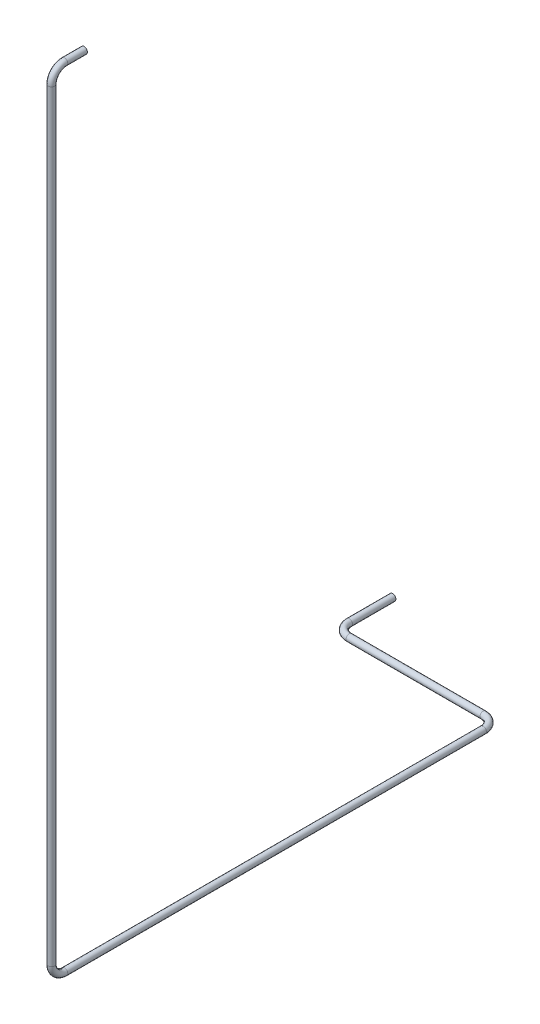
ISO-10303-21;
HEADER;
FILE_DESCRIPTION(('STEP AP214'),'2;1');
FILE_NAME('part.step','',(''),(''),'','','');
FILE_SCHEMA(('AUTOMOTIVE_DESIGN { 1 0 10303 214 1 1 1 1 }'));
ENDSEC;
DATA;
#1=APPLICATION_CONTEXT('core data for automotive mechanical design processes');
#2=APPLICATION_PROTOCOL_DEFINITION('international standard','automotive_design',2000,#1);
#3=PRODUCT_CONTEXT('',#1,'mechanical');
#4=PRODUCT('Part','Part','',(#3));
#5=PRODUCT_RELATED_PRODUCT_CATEGORY('part','',(#4));
#6=PRODUCT_DEFINITION_FORMATION('','',#4);
#7=PRODUCT_DEFINITION_CONTEXT('part definition',#1,'design');
#8=PRODUCT_DEFINITION('design','',#6,#7);
#9=PRODUCT_DEFINITION_SHAPE('','',#8);
#10=(LENGTH_UNIT() NAMED_UNIT(*) SI_UNIT(.MILLI.,.METRE.));
#11=(NAMED_UNIT(*) PLANE_ANGLE_UNIT() SI_UNIT($,.RADIAN.));
#12=(NAMED_UNIT(*) SI_UNIT($,.STERADIAN.) SOLID_ANGLE_UNIT());
#13=UNCERTAINTY_MEASURE_WITH_UNIT(LENGTH_MEASURE(1.E-05),#10,'distance_accuracy_value','');
#14=(GEOMETRIC_REPRESENTATION_CONTEXT(3) GLOBAL_UNCERTAINTY_ASSIGNED_CONTEXT((#13)) GLOBAL_UNIT_ASSIGNED_CONTEXT((#10,
#11,#12)) REPRESENTATION_CONTEXT('',''));
#15=CARTESIAN_POINT('',(0.,0.,0.));
#16=DIRECTION('',(0.,0.,1.));
#17=DIRECTION('',(1.,0.,0.));
#18=AXIS2_PLACEMENT_3D('',#15,#16,#17);
#19=CARTESIAN_POINT('',(-33126.1176832916,-14247.0136339342,43140.4701960568));
#20=DIRECTION('',(0.,0.,-1.));
#21=DIRECTION('',(1.,0.,0.));
#22=AXIS2_PLACEMENT_3D('',#19,#20,#21);
#23=PLANE('',#22);
#24=CARTESIAN_POINT('',(-33126.1176832916,-14247.0136339342,43140.4701960568));
#25=DIRECTION('',(0.,0.,-1.));
#26=DIRECTION('',(-1.,0.,0.));
#27=AXIS2_PLACEMENT_3D('',#24,#25,#26);
#28=CIRCLE('',#27,14.0000000000006);
#29=CARTESIAN_POINT('',(-33140.1176832916,-14247.0136339342,43140.4701960568));
#30=VERTEX_POINT('',#29);
#31=EDGE_CURVE('E88',#30,#30,#28,.T.);
#32=ORIENTED_EDGE('',*,*,#31,.F.);
#33=EDGE_LOOP('',(#32));
#34=FACE_BOUND('',#33,.T.);
#35=CARTESIAN_POINT('',(-33126.1176832916,-14247.0136339342,43140.4701960568));
#36=DIRECTION('',(0.,0.,-1.));
#37=DIRECTION('',(1.,0.,0.));
#38=AXIS2_PLACEMENT_3D('',#35,#36,#37);
#39=CIRCLE('',#38,15.0000000000006);
#40=CARTESIAN_POINT('',(-33111.1176832916,-14247.0136339342,43140.4701960568));
#41=VERTEX_POINT('',#40);
#42=EDGE_CURVE('E81',#41,#41,#39,.T.);
#43=ORIENTED_EDGE('',*,*,#42,.T.);
#44=EDGE_LOOP('',(#43));
#45=FACE_BOUND('',#44,.T.);
#46=ADVANCED_FACE('F47',(#34,#45),#23,.T.);
#47=CARTESIAN_POINT('',(-33860.3786769094,-17862.3317724565,40991.2422902798));
#48=DIRECTION('',(0.,0.,1.));
#49=DIRECTION('',(1.,0.,0.));
#50=AXIS2_PLACEMENT_3D('',#47,#48,#49);
#51=PLANE('',#50);
#52=CARTESIAN_POINT('',(-33860.3786769094,-17862.3317724565,40991.2422902798));
#53=DIRECTION('',(0.,0.,1.));
#54=DIRECTION('',(1.,0.,0.));
#55=AXIS2_PLACEMENT_3D('',#52,#53,#54);
#56=CIRCLE('',#55,14.0000000000006);
#57=CARTESIAN_POINT('',(-33846.3786769094,-17862.3317724565,40991.2422902798));
#58=VERTEX_POINT('',#57);
#59=EDGE_CURVE('E84',#58,#58,#56,.T.);
#60=ORIENTED_EDGE('',*,*,#59,.T.);
#61=EDGE_LOOP('',(#60));
#62=FACE_BOUND('',#61,.T.);
#63=CARTESIAN_POINT('',(-33860.3786769094,-17862.3317724565,40991.2422902798));
#64=DIRECTION('',(0.,0.,1.));
#65=DIRECTION('',(1.,0.,0.));
#66=AXIS2_PLACEMENT_3D('',#63,#64,#65);
#67=CIRCLE('',#66,15.0000000000006);
#68=CARTESIAN_POINT('',(-33845.3786769094,-17862.3317724565,40991.2422902798));
#69=VERTEX_POINT('',#68);
#70=EDGE_CURVE('E11',#69,#69,#67,.T.);
#71=ORIENTED_EDGE('',*,*,#70,.F.);
#72=EDGE_LOOP('',(#71));
#73=FACE_BOUND('',#72,.T.);
#74=ADVANCED_FACE('F126',(#62,#73),#51,.F.);
#75=CARTESIAN_POINT('',(-33126.1176832916,-14247.0136339342,43140.4701960568));
#76=DIRECTION('',(0.,0.,1.));
#77=DIRECTION('',(1.,0.,0.));
#78=AXIS2_PLACEMENT_3D('',#75,#76,#77);
#79=CYLINDRICAL_SURFACE('',#78,15.0000000000006);
#80=CARTESIAN_POINT('',(-33126.1176832916,-14247.0136339342,43230.4701960568));
#81=DIRECTION('',(0.,0.,-1.));
#82=DIRECTION('',(1.,0.,0.));
#83=AXIS2_PLACEMENT_3D('',#80,#81,#82);
#84=CIRCLE('',#83,15.0000000000006);
#85=CARTESIAN_POINT('',(-33126.1176832916,-14232.0136339342,43230.4701960568));
#86=VERTEX_POINT('',#85);
#87=EDGE_CURVE('E78',#86,#86,#84,.T.);
#88=ORIENTED_EDGE('',*,*,#87,.T.);
#89=EDGE_LOOP('',(#88));
#90=FACE_BOUND('',#89,.T.);
#91=ORIENTED_EDGE('',*,*,#42,.F.);
#92=EDGE_LOOP('',(#91));
#93=FACE_BOUND('',#92,.T.);
#94=ADVANCED_FACE('F130',(#90,#93),#79,.T.);
#95=CARTESIAN_POINT('',(-33126.1176832916,-14307.0136339342,43230.4701960568));
#96=DIRECTION('',(1.,0.,0.));
#97=DIRECTION('',(0.,0.,-1.));
#98=AXIS2_PLACEMENT_3D('',#95,#96,#97);
#99=TOROIDAL_SURFACE('',#98,60.0000000000023,15.0000000000006);
#100=CARTESIAN_POINT('',(-33126.1176832916,-14307.0136339342,43290.4701960568));
#101=DIRECTION('',(0.,1.,0.));
#102=DIRECTION('',(1.,0.,0.));
#103=AXIS2_PLACEMENT_3D('',#100,#101,#102);
#104=CIRCLE('',#103,15.0000000000006);
#105=CARTESIAN_POINT('',(-33126.1176832916,-14307.0136339342,43305.4701960568));
#106=VERTEX_POINT('',#105);
#107=EDGE_CURVE('E75',#106,#106,#104,.T.);
#108=CARTESIAN_POINT('',(-33126.1176832916,-14307.0136339342,43230.4701960568));
#109=DIRECTION('',(1.,0.,0.));
#110=DIRECTION('',(0.,0.,-1.));
#111=AXIS2_PLACEMENT_3D('',#108,#109,#110);
#112=CIRCLE('',#111,75.0000000000028);
#113=EDGE_CURVE('',#86,#106,#112,.T.);
#114=ORIENTED_EDGE('',*,*,#87,.F.);
#115=ORIENTED_EDGE('',*,*,#107,.T.);
#116=ORIENTED_EDGE('',*,*,#113,.T.);
#117=ORIENTED_EDGE('',*,*,#113,.F.);
#118=EDGE_LOOP('',(#114,#116,#115,#117));
#119=FACE_BOUND('',#118,.T.);
#120=ADVANCED_FACE('F132',(#119),#99,.T.);
#121=CARTESIAN_POINT('',(-33126.1176832916,-14307.0136339342,43290.4701960568));
#122=DIRECTION('',(0.,-1.,0.));
#123=DIRECTION('',(0.,0.,-1.));
#124=AXIS2_PLACEMENT_3D('',#121,#122,#123);
#125=CYLINDRICAL_SURFACE('',#124,15.0000000000006);
#126=CARTESIAN_POINT('',(-33126.1176832916,-17802.3317724565,43290.4701960568));
#127=DIRECTION('',(0.,1.,0.));
#128=DIRECTION('',(1.,0.,0.));
#129=AXIS2_PLACEMENT_3D('',#126,#127,#128);
#130=CIRCLE('',#129,15.0000000000006);
#131=CARTESIAN_POINT('',(-33126.1176832916,-17802.3317724565,43305.4701960568));
#132=VERTEX_POINT('',#131);
#133=EDGE_CURVE('E72',#132,#132,#130,.T.);
#134=ORIENTED_EDGE('',*,*,#133,.T.);
#135=EDGE_LOOP('',(#134));
#136=FACE_BOUND('',#135,.T.);
#137=ORIENTED_EDGE('',*,*,#107,.F.);
#138=EDGE_LOOP('',(#137));
#139=FACE_BOUND('',#138,.T.);
#140=ADVANCED_FACE('F139',(#136,#139),#125,.T.);
#141=CARTESIAN_POINT('',(-33126.1176832916,-17802.3317724565,43230.4701960568));
#142=DIRECTION('',(1.,0.,0.));
#143=DIRECTION('',(0.,0.,-1.));
#144=AXIS2_PLACEMENT_3D('',#141,#142,#143);
#145=TOROIDAL_SURFACE('',#144,60.0000000000023,15.0000000000006);
#146=CARTESIAN_POINT('',(-33126.1176832916,-17862.3317724614,43230.4701960547));
#147=DIRECTION('',(0.,0.,1.));
#148=DIRECTION('',(1.,0.,0.));
#149=AXIS2_PLACEMENT_3D('',#146,#147,#148);
#150=CIRCLE('',#149,15.0000000000006);
#151=CARTESIAN_POINT('',(-33126.1176832916,-17877.3317724565,43230.4701960542));
#152=VERTEX_POINT('',#151);
#153=EDGE_CURVE('E69',#152,#152,#150,.T.);
#154=CARTESIAN_POINT('',(-33126.1176832916,-17802.3317724565,43230.4701960568));
#155=DIRECTION('',(1.,0.,0.));
#156=DIRECTION('',(0.,0.,-1.));
#157=AXIS2_PLACEMENT_3D('',#154,#155,#156);
#158=CIRCLE('',#157,75.0000000000028);
#159=EDGE_CURVE('',#132,#152,#158,.T.);
#160=ORIENTED_EDGE('',*,*,#133,.F.);
#161=ORIENTED_EDGE('',*,*,#153,.T.);
#162=ORIENTED_EDGE('',*,*,#159,.T.);
#163=ORIENTED_EDGE('',*,*,#159,.F.);
#164=EDGE_LOOP('',(#160,#162,#161,#163));
#165=FACE_BOUND('',#164,.T.);
#166=ADVANCED_FACE('F164',(#165),#145,.T.);
#167=CARTESIAN_POINT('',(-33126.1176832916,-17862.3317724565,43230.4701960568));
#168=DIRECTION('',(0.,0.,-1.));
#169=DIRECTION('',(-1.,0.,0.));
#170=AXIS2_PLACEMENT_3D('',#167,#168,#169);
#171=CYLINDRICAL_SURFACE('',#170,15.0000000000006);
#172=CARTESIAN_POINT('',(-33126.1176832916,-17862.3317724565,41310.1350518645));
#173=DIRECTION('',(0.,0.,1.));
#174=DIRECTION('',(1.,0.,0.));
#175=AXIS2_PLACEMENT_3D('',#172,#173,#174);
#176=CIRCLE('',#175,15.0000000000006);
#177=CARTESIAN_POINT('',(-33111.1176832916,-17862.3317724565,41310.1350518645));
#178=VERTEX_POINT('',#177);
#179=EDGE_CURVE('E66',#178,#178,#176,.T.);
#180=ORIENTED_EDGE('',*,*,#179,.T.);
#181=EDGE_LOOP('',(#180));
#182=FACE_BOUND('',#181,.T.);
#183=ORIENTED_EDGE('',*,*,#153,.F.);
#184=EDGE_LOOP('',(#183));
#185=FACE_BOUND('',#184,.T.);
#186=ADVANCED_FACE('F160',(#182,#185),#171,.T.);
#187=CARTESIAN_POINT('',(-33186.1176832916,-17862.3317724565,41310.1350518645));
#188=DIRECTION('',(0.,1.,0.));
#189=DIRECTION('',(0.,0.,1.));
#190=AXIS2_PLACEMENT_3D('',#187,#188,#189);
#191=TOROIDAL_SURFACE('',#190,60.0000000000023,15.0000000000006);
#192=CARTESIAN_POINT('',(-33186.1176832916,-17862.3317724565,41250.1350518645));
#193=DIRECTION('',(1.,0.,0.));
#194=DIRECTION('',(0.,0.,-1.));
#195=AXIS2_PLACEMENT_3D('',#192,#193,#194);
#196=CIRCLE('',#195,15.0000000000006);
#197=CARTESIAN_POINT('',(-33186.1176832916,-17862.3317724565,41235.1350518645));
#198=VERTEX_POINT('',#197);
#199=EDGE_CURVE('E61',#198,#198,#196,.T.);
#200=CARTESIAN_POINT('',(-33186.1176832916,-17862.3317724565,41310.1350518645));
#201=DIRECTION('',(0.,1.,0.));
#202=DIRECTION('',(0.,0.,1.));
#203=AXIS2_PLACEMENT_3D('',#200,#201,#202);
#204=CIRCLE('',#203,75.0000000000028);
#205=EDGE_CURVE('',#178,#198,#204,.T.);
#206=ORIENTED_EDGE('',*,*,#179,.F.);
#207=ORIENTED_EDGE('',*,*,#199,.T.);
#208=ORIENTED_EDGE('',*,*,#205,.T.);
#209=ORIENTED_EDGE('',*,*,#205,.F.);
#210=EDGE_LOOP('',(#206,#208,#207,#209));
#211=FACE_BOUND('',#210,.T.);
#212=ADVANCED_FACE('F156',(#211),#191,.T.);
#213=CARTESIAN_POINT('',(-33186.1176832916,-17862.3317724565,41250.1350518645));
#214=DIRECTION('',(-1.,0.,0.));
#215=DIRECTION('',(0.,0.,1.));
#216=AXIS2_PLACEMENT_3D('',#213,#214,#215);
#217=CYLINDRICAL_SURFACE('',#216,15.0000000000006);
#218=CARTESIAN_POINT('',(-33800.3786769094,-17862.3317724565,41250.1350518645));
#219=DIRECTION('',(1.,0.,0.));
#220=DIRECTION('',(0.,0.,-1.));
#221=AXIS2_PLACEMENT_3D('',#218,#219,#220);
#222=CIRCLE('',#221,15.0000000000006);
#223=CARTESIAN_POINT('',(-33800.3786769094,-17862.3317724565,41265.1350518645));
#224=VERTEX_POINT('',#223);
#225=EDGE_CURVE('E57',#224,#224,#222,.T.);
#226=ORIENTED_EDGE('',*,*,#225,.T.);
#227=EDGE_LOOP('',(#226));
#228=FACE_BOUND('',#227,.T.);
#229=ORIENTED_EDGE('',*,*,#199,.F.);
#230=EDGE_LOOP('',(#229));
#231=FACE_BOUND('',#230,.T.);
#232=ADVANCED_FACE('F150',(#228,#231),#217,.T.);
#233=CARTESIAN_POINT('',(-33800.3786769094,-17862.3317724565,41190.1350518645));
#234=DIRECTION('',(0.,-1.,0.));
#235=DIRECTION('',(0.,0.,-1.));
#236=AXIS2_PLACEMENT_3D('',#233,#234,#235);
#237=TOROIDAL_SURFACE('',#236,60.0000000000023,15.0000000000006);
#238=CARTESIAN_POINT('',(-33860.3786769142,-17862.3317724565,41190.1350518605));
#239=DIRECTION('',(0.,0.,1.));
#240=DIRECTION('',(1.,0.,0.));
#241=AXIS2_PLACEMENT_3D('',#238,#239,#240);
#242=CIRCLE('',#241,15.0000000000006);
#243=CARTESIAN_POINT('',(-33875.3786769094,-17862.3317724565,41190.1350518595));
#244=VERTEX_POINT('',#243);
#245=EDGE_CURVE('E53',#244,#244,#242,.T.);
#246=CARTESIAN_POINT('',(-33800.3786769094,-17862.3317724565,41190.1350518645));
#247=DIRECTION('',(0.,-1.,0.));
#248=DIRECTION('',(0.,0.,-1.));
#249=AXIS2_PLACEMENT_3D('',#246,#247,#248);
#250=CIRCLE('',#249,75.0000000000028);
#251=EDGE_CURVE('',#224,#244,#250,.T.);
#252=ORIENTED_EDGE('',*,*,#225,.F.);
#253=ORIENTED_EDGE('',*,*,#245,.T.);
#254=ORIENTED_EDGE('',*,*,#251,.T.);
#255=ORIENTED_EDGE('',*,*,#251,.F.);
#256=EDGE_LOOP('',(#252,#254,#253,#255));
#257=FACE_BOUND('',#256,.T.);
#258=ADVANCED_FACE('F145',(#257),#237,.T.);
#259=CARTESIAN_POINT('',(-33860.3786769094,-17862.3317724565,41190.1350518645));
#260=DIRECTION('',(0.,0.,-1.));
#261=DIRECTION('',(-1.,0.,0.));
#262=AXIS2_PLACEMENT_3D('',#259,#260,#261);
#263=CYLINDRICAL_SURFACE('',#262,15.0000000000006);
#264=ORIENTED_EDGE('',*,*,#70,.T.);
#265=EDGE_LOOP('',(#264));
#266=FACE_BOUND('',#265,.T.);
#267=ORIENTED_EDGE('',*,*,#245,.F.);
#268=EDGE_LOOP('',(#267));
#269=FACE_BOUND('',#268,.T.);
#270=ADVANCED_FACE('F120',(#266,#269),#263,.T.);
#271=CARTESIAN_POINT('',(-33126.1176832916,-14247.0136339342,43140.4701960568));
#272=DIRECTION('',(0.,0.,1.));
#273=DIRECTION('',(1.,0.,0.));
#274=AXIS2_PLACEMENT_3D('',#271,#272,#273);
#275=CYLINDRICAL_SURFACE('',#274,14.0000000000006);
#276=CARTESIAN_POINT('',(-33126.1176832916,-14247.0136339342,43230.4701960568));
#277=DIRECTION('',(0.,0.,1.));
#278=DIRECTION('',(1.,0.,0.));
#279=AXIS2_PLACEMENT_3D('',#276,#277,#278);
#280=CIRCLE('',#279,14.0000000000006);
#281=CARTESIAN_POINT('',(-33126.1176832916,-14233.0136339342,43230.4701960568));
#282=VERTEX_POINT('',#281);
#283=EDGE_CURVE('E91',#282,#282,#280,.F.);
#284=ORIENTED_EDGE('',*,*,#283,.F.);
#285=EDGE_LOOP('',(#284));
#286=FACE_BOUND('',#285,.T.);
#287=ORIENTED_EDGE('',*,*,#31,.T.);
#288=EDGE_LOOP('',(#287));
#289=FACE_BOUND('',#288,.T.);
#290=ADVANCED_FACE('F117',(#286,#289),#275,.F.);
#291=CARTESIAN_POINT('',(-33126.1176832916,-14307.0136339342,43230.4701960568));
#292=DIRECTION('',(1.,0.,0.));
#293=DIRECTION('',(0.,0.,-1.));
#294=AXIS2_PLACEMENT_3D('',#291,#292,#293);
#295=TOROIDAL_SURFACE('',#294,60.0000000000023,14.0000000000006);
#296=CARTESIAN_POINT('',(-33126.1176832916,-14307.0136339342,43290.4701960568));
#297=DIRECTION('',(0.,1.,0.));
#298=DIRECTION('',(0.,0.,1.));
#299=AXIS2_PLACEMENT_3D('',#296,#297,#298);
#300=CIRCLE('',#299,14.0000000000006);
#301=CARTESIAN_POINT('',(-33126.1176832916,-14307.0136339342,43304.4701960568));
#302=VERTEX_POINT('',#301);
#303=EDGE_CURVE('E109',#302,#302,#300,.T.);
#304=CARTESIAN_POINT('',(-33126.1176832916,-14307.0136339342,43230.4701960568));
#305=DIRECTION('',(1.,0.,0.));
#306=DIRECTION('',(0.,0.,-1.));
#307=AXIS2_PLACEMENT_3D('',#304,#305,#306);
#308=CIRCLE('',#307,74.0000000000028);
#309=EDGE_CURVE('',#282,#302,#308,.T.);
#310=ORIENTED_EDGE('',*,*,#283,.T.);
#311=ORIENTED_EDGE('',*,*,#303,.F.);
#312=ORIENTED_EDGE('',*,*,#309,.T.);
#313=ORIENTED_EDGE('',*,*,#309,.F.);
#314=EDGE_LOOP('',(#310,#312,#311,#313));
#315=FACE_BOUND('',#314,.T.);
#316=ADVANCED_FACE('F115',(#315),#295,.F.);
#317=CARTESIAN_POINT('',(-33126.1176832916,-14307.0136339342,43290.4701960568));
#318=DIRECTION('',(0.,-1.,0.));
#319=DIRECTION('',(0.,0.,-1.));
#320=AXIS2_PLACEMENT_3D('',#317,#318,#319);
#321=CYLINDRICAL_SURFACE('',#320,14.0000000000006);
#322=CARTESIAN_POINT('',(-33126.1176832916,-17802.3317724565,43290.4701960568));
#323=DIRECTION('',(0.,-1.,0.));
#324=DIRECTION('',(0.,0.,-1.));
#325=AXIS2_PLACEMENT_3D('',#322,#323,#324);
#326=CIRCLE('',#325,14.0000000000006);
#327=CARTESIAN_POINT('',(-33126.1176832916,-17802.3317724565,43304.4701960568));
#328=VERTEX_POINT('',#327);
#329=EDGE_CURVE('E106',#328,#328,#326,.F.);
#330=ORIENTED_EDGE('',*,*,#329,.F.);
#331=EDGE_LOOP('',(#330));
#332=FACE_BOUND('',#331,.T.);
#333=ORIENTED_EDGE('',*,*,#303,.T.);
#334=EDGE_LOOP('',(#333));
#335=FACE_BOUND('',#334,.T.);
#336=ADVANCED_FACE('F223',(#332,#335),#321,.F.);
#337=CARTESIAN_POINT('',(-33126.1176832916,-17802.3317724565,43230.4701960568));
#338=DIRECTION('',(1.,0.,0.));
#339=DIRECTION('',(0.,0.,-1.));
#340=AXIS2_PLACEMENT_3D('',#337,#338,#339);
#341=TOROIDAL_SURFACE('',#340,60.0000000000023,14.0000000000006);
#342=CARTESIAN_POINT('',(-33126.1176832916,-17862.3317724565,43230.4701960547));
#343=DIRECTION('',(0.,0.,-1.));
#344=DIRECTION('',(-1.,0.,0.));
#345=AXIS2_PLACEMENT_3D('',#342,#343,#344);
#346=CIRCLE('',#345,14.0000000000006);
#347=CARTESIAN_POINT('',(-33126.1176832916,-17876.3317724565,43230.4701960542));
#348=VERTEX_POINT('',#347);
#349=EDGE_CURVE('E103',#348,#348,#346,.F.);
#350=CARTESIAN_POINT('',(-33126.1176832916,-17802.3317724565,43230.4701960568));
#351=DIRECTION('',(1.,0.,0.));
#352=DIRECTION('',(0.,0.,-1.));
#353=AXIS2_PLACEMENT_3D('',#350,#351,#352);
#354=CIRCLE('',#353,74.0000000000028);
#355=EDGE_CURVE('',#328,#348,#354,.T.);
#356=ORIENTED_EDGE('',*,*,#329,.T.);
#357=ORIENTED_EDGE('',*,*,#349,.F.);
#358=ORIENTED_EDGE('',*,*,#355,.T.);
#359=ORIENTED_EDGE('',*,*,#355,.F.);
#360=EDGE_LOOP('',(#356,#358,#357,#359));
#361=FACE_BOUND('',#360,.T.);
#362=ADVANCED_FACE('F234',(#361),#341,.F.);
#363=CARTESIAN_POINT('',(-33126.1176832916,-17862.3317724565,43230.4701960568));
#364=DIRECTION('',(0.,0.,-1.));
#365=DIRECTION('',(-1.,0.,0.));
#366=AXIS2_PLACEMENT_3D('',#363,#364,#365);
#367=CYLINDRICAL_SURFACE('',#366,14.0000000000006);
#368=CARTESIAN_POINT('',(-33126.1176832916,-17862.3317724565,41310.1350518645));
#369=DIRECTION('',(0.,0.,-1.));
#370=DIRECTION('',(-1.,0.,0.));
#371=AXIS2_PLACEMENT_3D('',#368,#369,#370);
#372=CIRCLE('',#371,14.0000000000006);
#373=CARTESIAN_POINT('',(-33112.1176832916,-17862.3317724565,41310.1350518645));
#374=VERTEX_POINT('',#373);
#375=EDGE_CURVE('E100',#374,#374,#372,.F.);
#376=ORIENTED_EDGE('',*,*,#375,.F.);
#377=EDGE_LOOP('',(#376));
#378=FACE_BOUND('',#377,.T.);
#379=ORIENTED_EDGE('',*,*,#349,.T.);
#380=EDGE_LOOP('',(#379));
#381=FACE_BOUND('',#380,.T.);
#382=ADVANCED_FACE('F245',(#378,#381),#367,.F.);
#383=CARTESIAN_POINT('',(-33186.1176832916,-17862.3317724565,41310.1350518645));
#384=DIRECTION('',(0.,1.,0.));
#385=DIRECTION('',(0.,0.,1.));
#386=AXIS2_PLACEMENT_3D('',#383,#384,#385);
#387=TOROIDAL_SURFACE('',#386,60.0000000000023,14.0000000000006);
#388=CARTESIAN_POINT('',(-33186.1176832916,-17862.3317724565,41250.1350518645));
#389=DIRECTION('',(1.,0.,0.));
#390=DIRECTION('',(0.,0.,-1.));
#391=AXIS2_PLACEMENT_3D('',#388,#389,#390);
#392=CIRCLE('',#391,14.0000000000006);
#393=CARTESIAN_POINT('',(-33186.1176832916,-17862.3317724565,41236.1350518645));
#394=VERTEX_POINT('',#393);
#395=EDGE_CURVE('E97',#394,#394,#392,.T.);
#396=CARTESIAN_POINT('',(-33186.1176832916,-17862.3317724565,41310.1350518645));
#397=DIRECTION('',(0.,1.,0.));
#398=DIRECTION('',(0.,0.,1.));
#399=AXIS2_PLACEMENT_3D('',#396,#397,#398);
#400=CIRCLE('',#399,74.0000000000028);
#401=EDGE_CURVE('',#374,#394,#400,.T.);
#402=ORIENTED_EDGE('',*,*,#375,.T.);
#403=ORIENTED_EDGE('',*,*,#395,.F.);
#404=ORIENTED_EDGE('',*,*,#401,.T.);
#405=ORIENTED_EDGE('',*,*,#401,.F.);
#406=EDGE_LOOP('',(#402,#404,#403,#405));
#407=FACE_BOUND('',#406,.T.);
#408=ADVANCED_FACE('F256',(#407),#387,.F.);
#409=CARTESIAN_POINT('',(-33186.1176832916,-17862.3317724565,41250.1350518645));
#410=DIRECTION('',(-1.,0.,0.));
#411=DIRECTION('',(0.,0.,1.));
#412=AXIS2_PLACEMENT_3D('',#409,#410,#411);
#413=CYLINDRICAL_SURFACE('',#412,14.0000000000006);
#414=CARTESIAN_POINT('',(-33800.3786769094,-17862.3317724565,41250.1350518645));
#415=DIRECTION('',(-1.,0.,0.));
#416=DIRECTION('',(0.,0.,1.));
#417=AXIS2_PLACEMENT_3D('',#414,#415,#416);
#418=CIRCLE('',#417,14.0000000000006);
#419=CARTESIAN_POINT('',(-33800.3786769094,-17862.3317724565,41264.1350518645));
#420=VERTEX_POINT('',#419);
#421=EDGE_CURVE('E94',#420,#420,#418,.F.);
#422=ORIENTED_EDGE('',*,*,#421,.F.);
#423=EDGE_LOOP('',(#422));
#424=FACE_BOUND('',#423,.T.);
#425=ORIENTED_EDGE('',*,*,#395,.T.);
#426=EDGE_LOOP('',(#425));
#427=FACE_BOUND('',#426,.T.);
#428=ADVANCED_FACE('F267',(#424,#427),#413,.F.);
#429=CARTESIAN_POINT('',(-33800.3786769094,-17862.3317724565,41190.1350518645));
#430=DIRECTION('',(0.,-1.,0.));
#431=DIRECTION('',(0.,0.,-1.));
#432=AXIS2_PLACEMENT_3D('',#429,#430,#431);
#433=TOROIDAL_SURFACE('',#432,60.0000000000023,14.0000000000006);
#434=CARTESIAN_POINT('',(-33860.3786769094,-17862.3317724565,41190.1350518605));
#435=DIRECTION('',(0.,0.,-1.));
#436=DIRECTION('',(-1.,0.,0.));
#437=AXIS2_PLACEMENT_3D('',#434,#435,#436);
#438=CIRCLE('',#437,14.0000000000006);
#439=CARTESIAN_POINT('',(-33874.3786769094,-17862.3317724565,41190.1350518595));
#440=VERTEX_POINT('',#439);
#441=EDGE_CURVE('E87',#440,#440,#438,.F.);
#442=CARTESIAN_POINT('',(-33800.3786769094,-17862.3317724565,41190.1350518645));
#443=DIRECTION('',(0.,-1.,0.));
#444=DIRECTION('',(0.,0.,-1.));
#445=AXIS2_PLACEMENT_3D('',#442,#443,#444);
#446=CIRCLE('',#445,74.0000000000028);
#447=EDGE_CURVE('',#420,#440,#446,.T.);
#448=ORIENTED_EDGE('',*,*,#421,.T.);
#449=ORIENTED_EDGE('',*,*,#441,.F.);
#450=ORIENTED_EDGE('',*,*,#447,.T.);
#451=ORIENTED_EDGE('',*,*,#447,.F.);
#452=EDGE_LOOP('',(#448,#450,#449,#451));
#453=FACE_BOUND('',#452,.T.);
#454=ADVANCED_FACE('F278',(#453),#433,.F.);
#455=CARTESIAN_POINT('',(-33860.3786769094,-17862.3317724565,41190.1350518645));
#456=DIRECTION('',(0.,0.,-1.));
#457=DIRECTION('',(-1.,0.,0.));
#458=AXIS2_PLACEMENT_3D('',#455,#456,#457);
#459=CYLINDRICAL_SURFACE('',#458,14.0000000000006);
#460=ORIENTED_EDGE('',*,*,#59,.F.);
#461=EDGE_LOOP('',(#460));
#462=FACE_BOUND('',#461,.T.);
#463=ORIENTED_EDGE('',*,*,#441,.T.);
#464=EDGE_LOOP('',(#463));
#465=FACE_BOUND('',#464,.T.);
#466=ADVANCED_FACE('F127',(#462,#465),#459,.F.);
#467=CLOSED_SHELL('',(#46,#74,#94,#120,#140,#166,#186,#212,#232,#258,#270,#290,#316,#336,#362,
#382,#408,#428,#454,#466));
#468=MANIFOLD_SOLID_BREP('B2',#467);
#469=ADVANCED_BREP_SHAPE_REPRESENTATION('',(#18,#468),#14);
#470=SHAPE_DEFINITION_REPRESENTATION(#9,#469);
ENDSEC;
END-ISO-10303-21;
